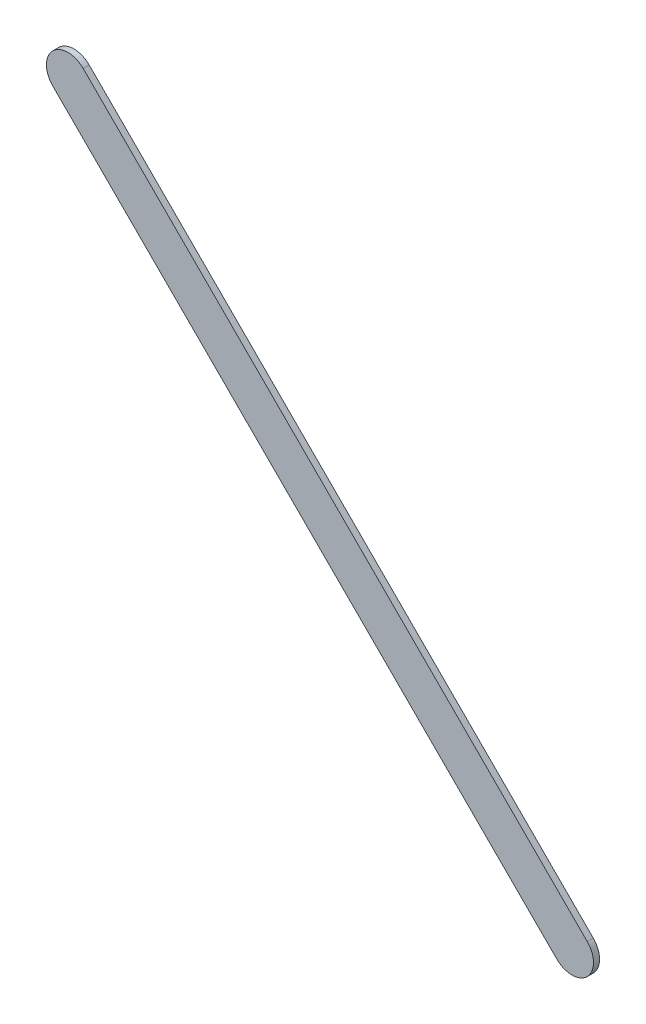
ISO-10303-21;
HEADER;
FILE_DESCRIPTION(('STEP AP214'),'2;1');
FILE_NAME('part.step','',(''),(''),'','','');
FILE_SCHEMA(('AUTOMOTIVE_DESIGN { 1 0 10303 214 1 1 1 1 }'));
ENDSEC;
DATA;
#1=APPLICATION_CONTEXT('core data for automotive mechanical design processes');
#2=APPLICATION_PROTOCOL_DEFINITION('international standard','automotive_design',2000,#1);
#3=PRODUCT_CONTEXT('',#1,'mechanical');
#4=PRODUCT('Part','Part','',(#3));
#5=PRODUCT_RELATED_PRODUCT_CATEGORY('part','',(#4));
#6=PRODUCT_DEFINITION_FORMATION('','',#4);
#7=PRODUCT_DEFINITION_CONTEXT('part definition',#1,'design');
#8=PRODUCT_DEFINITION('design','',#6,#7);
#9=PRODUCT_DEFINITION_SHAPE('','',#8);
#10=(LENGTH_UNIT() NAMED_UNIT(*) SI_UNIT(.MILLI.,.METRE.));
#11=(NAMED_UNIT(*) PLANE_ANGLE_UNIT() SI_UNIT($,.RADIAN.));
#12=(NAMED_UNIT(*) SI_UNIT($,.STERADIAN.) SOLID_ANGLE_UNIT());
#13=UNCERTAINTY_MEASURE_WITH_UNIT(LENGTH_MEASURE(1.E-05),#10,'distance_accuracy_value','');
#14=(GEOMETRIC_REPRESENTATION_CONTEXT(3) GLOBAL_UNCERTAINTY_ASSIGNED_CONTEXT((#13)) GLOBAL_UNIT_ASSIGNED_CONTEXT((#10,
#11,#12)) REPRESENTATION_CONTEXT('',''));
#15=CARTESIAN_POINT('',(0.,0.,0.));
#16=DIRECTION('',(0.,0.,1.));
#17=DIRECTION('',(1.,0.,0.));
#18=AXIS2_PLACEMENT_3D('',#15,#16,#17);
#19=CARTESIAN_POINT('',(78.42717106,81.8971692,0.));
#20=DIRECTION('',(0.707106781186548,0.707106781186548,0.));
#21=DIRECTION('',(0.707106781186548,-0.707106781186548,0.));
#22=AXIS2_PLACEMENT_3D('',#19,#20,#21);
#23=PLANE('',#22);
#24=DIRECTION('',(0.707106781186548,-0.707106781186548,0.));
#25=VECTOR('',#24,1.);
#26=CARTESIAN_POINT('',(78.42717106,81.8971692,0.03556));
#27=LINE('',#26,#25);
#28=CARTESIAN_POINT('',(78.42717106,81.8971692,0.03556));
#29=VERTEX_POINT('',#28);
#30=CARTESIAN_POINT('',(81.40515088,78.91918938,0.03556));
#31=VERTEX_POINT('',#30);
#32=EDGE_CURVE('E11',#29,#31,#27,.T.);
#33=ORIENTED_EDGE('',*,*,#32,.F.);
#34=DIRECTION('',(0.,0.,1.));
#35=VECTOR('',#34,1.);
#36=CARTESIAN_POINT('',(78.42717106,81.8971692,0.));
#37=LINE('',#36,#35);
#38=CARTESIAN_POINT('',(78.42717106,81.8971692,0.));
#39=VERTEX_POINT('',#38);
#40=EDGE_CURVE('E24',#39,#29,#37,.T.);
#41=ORIENTED_EDGE('',*,*,#40,.F.);
#42=DIRECTION('',(0.707106781186548,-0.707106781186548,0.));
#43=VECTOR('',#42,1.);
#44=CARTESIAN_POINT('',(78.42717106,81.8971692,0.));
#45=LINE('',#44,#43);
#46=CARTESIAN_POINT('',(81.40515088,78.91918938,0.));
#47=VERTEX_POINT('',#46);
#48=EDGE_CURVE('E75',#39,#47,#45,.T.);
#49=ORIENTED_EDGE('',*,*,#48,.T.);
#50=DIRECTION('',(0.,0.,1.));
#51=VECTOR('',#50,1.);
#52=CARTESIAN_POINT('',(81.40515088,78.91918938,0.));
#53=LINE('',#52,#51);
#54=EDGE_CURVE('E37',#47,#31,#53,.T.);
#55=ORIENTED_EDGE('',*,*,#54,.T.);
#56=EDGE_LOOP('',(#33,#41,#49,#55));
#57=FACE_BOUND('',#56,.T.);
#58=ADVANCED_FACE('F17',(#57),#23,.F.);
#59=CARTESIAN_POINT('',(81.49495258,79.00899235,0.));
#60=DIRECTION('',(0.,0.,-1.));
#61=DIRECTION('',(-0.707101781156225,-0.707111781181515,0.));
#62=AXIS2_PLACEMENT_3D('',#59,#60,#61);
#63=CYLINDRICAL_SURFACE('',#62,0.126999680092953);
#64=CARTESIAN_POINT('',(81.49495258,79.00899235,0.03556));
#65=DIRECTION('',(0.,0.,1.));
#66=DIRECTION('',(-0.707101781156225,-0.707111781181515,0.));
#67=AXIS2_PLACEMENT_3D('',#64,#65,#66);
#68=CIRCLE('',#67,0.126999680092953);
#69=CARTESIAN_POINT('',(81.58475428,79.09879532,0.03556));
#70=VERTEX_POINT('',#69);
#71=EDGE_CURVE('E83',#31,#70,#68,.T.);
#72=ORIENTED_EDGE('',*,*,#71,.F.);
#73=ORIENTED_EDGE('',*,*,#54,.F.);
#74=CARTESIAN_POINT('',(81.49495258,79.00899235,0.));
#75=DIRECTION('',(0.,0.,1.));
#76=DIRECTION('',(-0.707101781156225,-0.707111781181515,0.));
#77=AXIS2_PLACEMENT_3D('',#74,#75,#76);
#78=CIRCLE('',#77,0.126999680092953);
#79=CARTESIAN_POINT('',(81.58475428,79.09879532,0.));
#80=VERTEX_POINT('',#79);
#81=EDGE_CURVE('E81',#47,#80,#78,.T.);
#82=ORIENTED_EDGE('',*,*,#81,.T.);
#83=DIRECTION('',(0.,0.,1.));
#84=VECTOR('',#83,1.);
#85=CARTESIAN_POINT('',(81.58475428,79.09879532,0.));
#86=LINE('',#85,#84);
#87=EDGE_CURVE('E67',#80,#70,#86,.T.);
#88=ORIENTED_EDGE('',*,*,#87,.T.);
#89=EDGE_LOOP('',(#72,#73,#82,#88));
#90=FACE_BOUND('',#89,.T.);
#91=ADVANCED_FACE('F89',(#90),#63,.T.);
#92=CARTESIAN_POINT('',(81.58475428,79.09879532,0.));
#93=DIRECTION('',(-0.707106781186549,-0.707106781186546,0.));
#94=DIRECTION('',(-0.707106781186546,0.707106781186549,0.));
#95=AXIS2_PLACEMENT_3D('',#92,#93,#94);
#96=PLANE('',#95);
#97=DIRECTION('',(-0.707106781186546,0.707106781186549,0.));
#98=VECTOR('',#97,1.);
#99=CARTESIAN_POINT('',(81.58475428,79.09879532,0.03556));
#100=LINE('',#99,#98);
#101=CARTESIAN_POINT('',(78.606777,82.0767726,0.03556));
#102=VERTEX_POINT('',#101);
#103=EDGE_CURVE('E71',#70,#102,#100,.T.);
#104=ORIENTED_EDGE('',*,*,#103,.F.);
#105=ORIENTED_EDGE('',*,*,#87,.F.);
#106=DIRECTION('',(-0.707106781186546,0.707106781186549,0.));
#107=VECTOR('',#106,1.);
#108=CARTESIAN_POINT('',(81.58475428,79.09879532,0.));
#109=LINE('',#108,#107);
#110=CARTESIAN_POINT('',(78.606777,82.0767726,0.));
#111=VERTEX_POINT('',#110);
#112=EDGE_CURVE('E63',#80,#111,#109,.T.);
#113=ORIENTED_EDGE('',*,*,#112,.T.);
#114=DIRECTION('',(0.,0.,1.));
#115=VECTOR('',#114,1.);
#116=CARTESIAN_POINT('',(78.606777,82.0767726,0.));
#117=LINE('',#116,#115);
#118=EDGE_CURVE('E53',#111,#102,#117,.T.);
#119=ORIENTED_EDGE('',*,*,#118,.T.);
#120=EDGE_LOOP('',(#104,#105,#113,#119));
#121=FACE_BOUND('',#120,.T.);
#122=ADVANCED_FACE('F66',(#121),#96,.F.);
#123=CARTESIAN_POINT('',(78.51697403,81.9869709,0.));
#124=DIRECTION('',(0.,0.,-1.));
#125=DIRECTION('',(0.707111781181459,0.707101781156281,0.));
#126=AXIS2_PLACEMENT_3D('',#123,#124,#125);
#127=CYLINDRICAL_SURFACE('',#126,0.126999680092956);
#128=CARTESIAN_POINT('',(78.51697403,81.9869709,0.03556));
#129=DIRECTION('',(0.,0.,1.));
#130=DIRECTION('',(0.707111781181459,0.707101781156281,0.));
#131=AXIS2_PLACEMENT_3D('',#128,#129,#130);
#132=CIRCLE('',#131,0.126999680092956);
#133=EDGE_CURVE('E59',#102,#29,#132,.T.);
#134=ORIENTED_EDGE('',*,*,#133,.F.);
#135=ORIENTED_EDGE('',*,*,#118,.F.);
#136=CARTESIAN_POINT('',(78.51697403,81.9869709,0.));
#137=DIRECTION('',(0.,0.,1.));
#138=DIRECTION('',(0.707111781181459,0.707101781156281,0.));
#139=AXIS2_PLACEMENT_3D('',#136,#137,#138);
#140=CIRCLE('',#139,0.126999680092956);
#141=EDGE_CURVE('E57',#111,#39,#140,.T.);
#142=ORIENTED_EDGE('',*,*,#141,.T.);
#143=ORIENTED_EDGE('',*,*,#40,.T.);
#144=EDGE_LOOP('',(#134,#135,#142,#143));
#145=FACE_BOUND('',#144,.T.);
#146=ADVANCED_FACE('F55',(#145),#127,.T.);
#147=CARTESIAN_POINT('',(78.42717106,81.8971692,0.));
#148=DIRECTION('',(0.,0.,-1.));
#149=DIRECTION('',(-1.,0.,0.));
#150=AXIS2_PLACEMENT_3D('',#147,#148,#149);
#151=PLANE('',#150);
#152=ORIENTED_EDGE('',*,*,#141,.F.);
#153=ORIENTED_EDGE('',*,*,#112,.F.);
#154=ORIENTED_EDGE('',*,*,#81,.F.);
#155=ORIENTED_EDGE('',*,*,#48,.F.);
#156=EDGE_LOOP('',(#152,#153,#154,#155));
#157=FACE_BOUND('',#156,.T.);
#158=ADVANCED_FACE('F74',(#157),#151,.T.);
#159=CARTESIAN_POINT('',(78.42717106,81.8971692,0.03556));
#160=DIRECTION('',(0.,0.,-1.));
#161=DIRECTION('',(-1.,0.,0.));
#162=AXIS2_PLACEMENT_3D('',#159,#160,#161);
#163=PLANE('',#162);
#164=ORIENTED_EDGE('',*,*,#32,.T.);
#165=ORIENTED_EDGE('',*,*,#71,.T.);
#166=ORIENTED_EDGE('',*,*,#103,.T.);
#167=ORIENTED_EDGE('',*,*,#133,.T.);
#168=EDGE_LOOP('',(#164,#165,#166,#167));
#169=FACE_BOUND('',#168,.T.);
#170=ADVANCED_FACE('F91',(#169),#163,.F.);
#171=CLOSED_SHELL('',(#58,#91,#122,#146,#158,#170));
#172=MANIFOLD_SOLID_BREP('B1',#171);
#173=ADVANCED_BREP_SHAPE_REPRESENTATION('',(#18,#172),#14);
#174=SHAPE_DEFINITION_REPRESENTATION(#9,#173);
ENDSEC;
END-ISO-10303-21;
